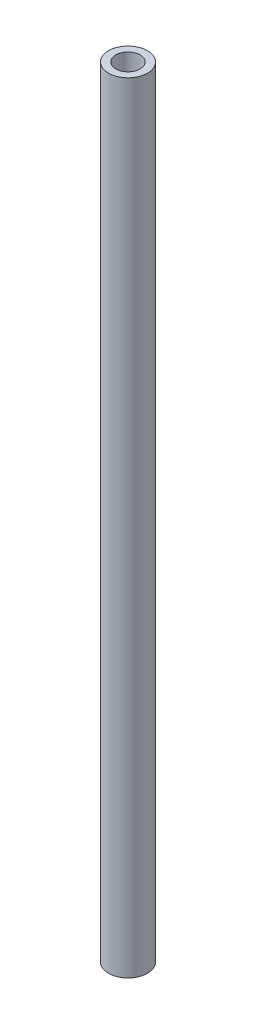
ISO-10303-21;
HEADER;
FILE_DESCRIPTION(('STEP AP214'),'2;1');
FILE_NAME('part.step','',(''),(''),'','','');
FILE_SCHEMA(('AUTOMOTIVE_DESIGN { 1 0 10303 214 1 1 1 1 }'));
ENDSEC;
DATA;
#1=APPLICATION_CONTEXT('core data for automotive mechanical design processes');
#2=APPLICATION_PROTOCOL_DEFINITION('international standard','automotive_design',2000,#1);
#3=PRODUCT_CONTEXT('',#1,'mechanical');
#4=PRODUCT('Part','Part','',(#3));
#5=PRODUCT_RELATED_PRODUCT_CATEGORY('part','',(#4));
#6=PRODUCT_DEFINITION_FORMATION('','',#4);
#7=PRODUCT_DEFINITION_CONTEXT('part definition',#1,'design');
#8=PRODUCT_DEFINITION('design','',#6,#7);
#9=PRODUCT_DEFINITION_SHAPE('','',#8);
#10=(LENGTH_UNIT() NAMED_UNIT(*) SI_UNIT(.MILLI.,.METRE.));
#11=(NAMED_UNIT(*) PLANE_ANGLE_UNIT() SI_UNIT($,.RADIAN.));
#12=(NAMED_UNIT(*) SI_UNIT($,.STERADIAN.) SOLID_ANGLE_UNIT());
#13=UNCERTAINTY_MEASURE_WITH_UNIT(LENGTH_MEASURE(1.E-05),#10,'distance_accuracy_value','');
#14=(GEOMETRIC_REPRESENTATION_CONTEXT(3) GLOBAL_UNCERTAINTY_ASSIGNED_CONTEXT((#13)) GLOBAL_UNIT_ASSIGNED_CONTEXT((#10,
#11,#12)) REPRESENTATION_CONTEXT('',''));
#15=CARTESIAN_POINT('',(0.,0.,0.));
#16=DIRECTION('',(0.,0.,1.));
#17=DIRECTION('',(1.,0.,0.));
#18=AXIS2_PLACEMENT_3D('',#15,#16,#17);
#19=CARTESIAN_POINT('',(0.,508.,0.));
#20=DIRECTION('',(0.,1.,0.));
#21=DIRECTION('',(0.,0.,1.));
#22=AXIS2_PLACEMENT_3D('',#19,#20,#21);
#23=PLANE('',#22);
#24=CARTESIAN_POINT('',(0.,508.,0.));
#25=DIRECTION('',(0.,1.,0.));
#26=DIRECTION('',(0.,0.,1.));
#27=AXIS2_PLACEMENT_3D('',#24,#25,#26);
#28=CIRCLE('',#27,12.7);
#29=CARTESIAN_POINT('',(0.,508.,12.7));
#30=VERTEX_POINT('',#29);
#31=EDGE_CURVE('E10',#30,#30,#28,.T.);
#32=ORIENTED_EDGE('',*,*,#31,.T.);
#33=EDGE_LOOP('',(#32));
#34=FACE_BOUND('',#33,.T.);
#35=CARTESIAN_POINT('',(0.,508.,0.));
#36=DIRECTION('',(0.,1.,0.));
#37=DIRECTION('',(0.,0.,1.));
#38=AXIS2_PLACEMENT_3D('',#35,#36,#37);
#39=CIRCLE('',#38,7.9375);
#40=CARTESIAN_POINT('',(0.,508.,7.9375));
#41=VERTEX_POINT('',#40);
#42=EDGE_CURVE('E44',#41,#41,#39,.T.);
#43=ORIENTED_EDGE('',*,*,#42,.F.);
#44=EDGE_LOOP('',(#43));
#45=FACE_BOUND('',#44,.T.);
#46=ADVANCED_FACE('F33',(#34,#45),#23,.T.);
#47=CARTESIAN_POINT('',(0.,0.,0.));
#48=DIRECTION('',(0.,1.,0.));
#49=DIRECTION('',(0.,0.,1.));
#50=AXIS2_PLACEMENT_3D('',#47,#48,#49);
#51=PLANE('',#50);
#52=CARTESIAN_POINT('',(0.,0.,0.));
#53=DIRECTION('',(0.,1.,0.));
#54=DIRECTION('',(0.,0.,1.));
#55=AXIS2_PLACEMENT_3D('',#52,#53,#54);
#56=CIRCLE('',#55,12.7);
#57=CARTESIAN_POINT('',(0.,0.,12.7));
#58=VERTEX_POINT('',#57);
#59=EDGE_CURVE('E37',#58,#58,#56,.T.);
#60=ORIENTED_EDGE('',*,*,#59,.F.);
#61=EDGE_LOOP('',(#60));
#62=FACE_BOUND('',#61,.T.);
#63=CARTESIAN_POINT('',(0.,0.,0.));
#64=DIRECTION('',(0.,1.,0.));
#65=DIRECTION('',(0.,0.,1.));
#66=AXIS2_PLACEMENT_3D('',#63,#64,#65);
#67=CIRCLE('',#66,7.9375);
#68=CARTESIAN_POINT('',(0.,0.,7.9375));
#69=VERTEX_POINT('',#68);
#70=EDGE_CURVE('E46',#69,#69,#67,.T.);
#71=ORIENTED_EDGE('',*,*,#70,.T.);
#72=EDGE_LOOP('',(#71));
#73=FACE_BOUND('',#72,.T.);
#74=ADVANCED_FACE('F56',(#62,#73),#51,.F.);
#75=CARTESIAN_POINT('',(0.,508.,0.));
#76=DIRECTION('',(0.,-1.,0.));
#77=DIRECTION('',(0.,0.,-1.));
#78=AXIS2_PLACEMENT_3D('',#75,#76,#77);
#79=CYLINDRICAL_SURFACE('',#78,12.7);
#80=ORIENTED_EDGE('',*,*,#31,.F.);
#81=EDGE_LOOP('',(#80));
#82=FACE_BOUND('',#81,.T.);
#83=ORIENTED_EDGE('',*,*,#59,.T.);
#84=EDGE_LOOP('',(#83));
#85=FACE_BOUND('',#84,.T.);
#86=ADVANCED_FACE('F35',(#82,#85),#79,.T.);
#87=CARTESIAN_POINT('',(0.,508.,0.));
#88=DIRECTION('',(0.,-1.,0.));
#89=DIRECTION('',(0.,0.,-1.));
#90=AXIS2_PLACEMENT_3D('',#87,#88,#89);
#91=CYLINDRICAL_SURFACE('',#90,7.9375);
#92=ORIENTED_EDGE('',*,*,#42,.T.);
#93=EDGE_LOOP('',(#92));
#94=FACE_BOUND('',#93,.T.);
#95=ORIENTED_EDGE('',*,*,#70,.F.);
#96=EDGE_LOOP('',(#95));
#97=FACE_BOUND('',#96,.T.);
#98=ADVANCED_FACE('F52',(#94,#97),#91,.F.);
#99=CLOSED_SHELL('',(#46,#74,#86,#98));
#100=MANIFOLD_SOLID_BREP('B2',#99);
#101=ADVANCED_BREP_SHAPE_REPRESENTATION('',(#18,#100),#14);
#102=SHAPE_DEFINITION_REPRESENTATION(#9,#101);
ENDSEC;
END-ISO-10303-21;
